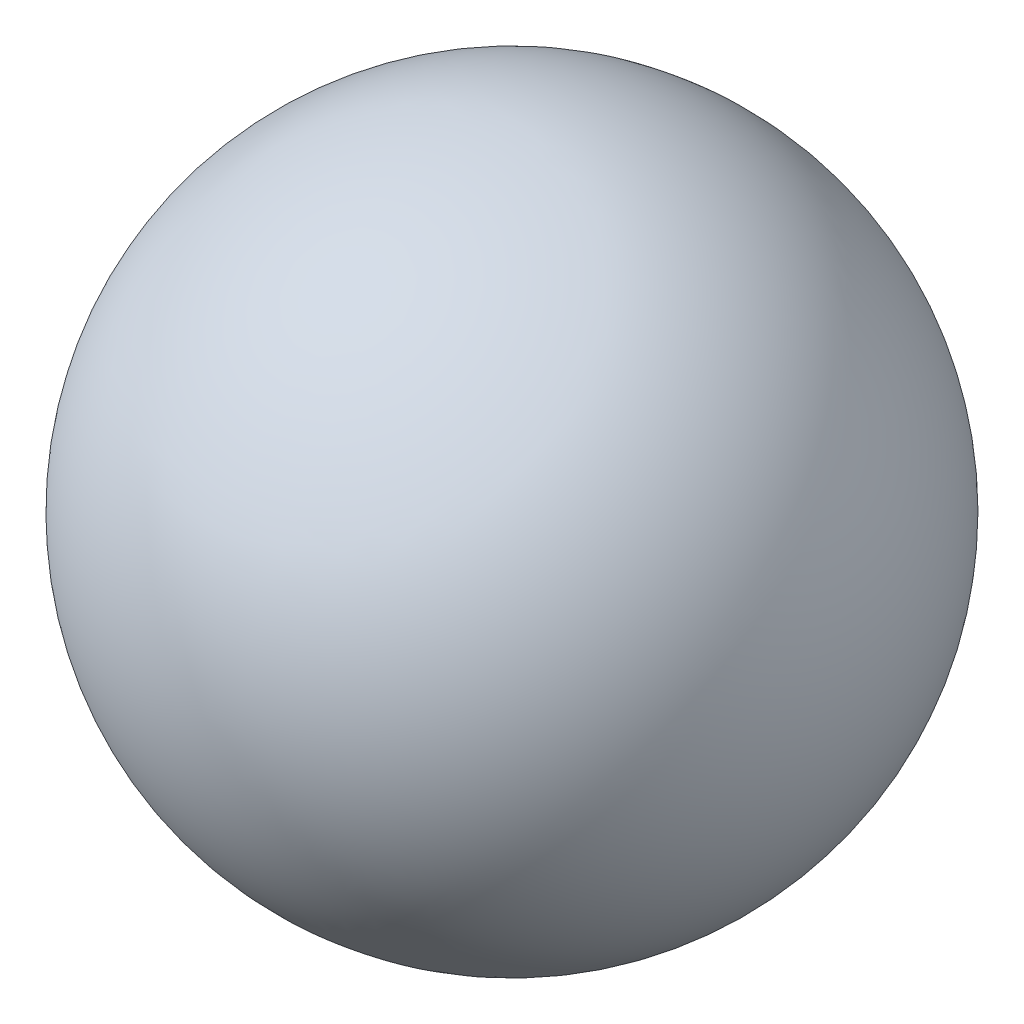
ISO-10303-21;
HEADER;
FILE_DESCRIPTION(('STEP AP214'),'2;1');
FILE_NAME('part.step','',(''),(''),'','','');
FILE_SCHEMA(('AUTOMOTIVE_DESIGN { 1 0 10303 214 1 1 1 1 }'));
ENDSEC;
DATA;
#1=APPLICATION_CONTEXT('core data for automotive mechanical design processes');
#2=APPLICATION_PROTOCOL_DEFINITION('international standard','automotive_design',2000,#1);
#3=PRODUCT_CONTEXT('',#1,'mechanical');
#4=PRODUCT('Part','Part','',(#3));
#5=PRODUCT_RELATED_PRODUCT_CATEGORY('part','',(#4));
#6=PRODUCT_DEFINITION_FORMATION('','',#4);
#7=PRODUCT_DEFINITION_CONTEXT('part definition',#1,'design');
#8=PRODUCT_DEFINITION('design','',#6,#7);
#9=PRODUCT_DEFINITION_SHAPE('','',#8);
#10=(LENGTH_UNIT() NAMED_UNIT(*) SI_UNIT(.MILLI.,.METRE.));
#11=(NAMED_UNIT(*) PLANE_ANGLE_UNIT() SI_UNIT($,.RADIAN.));
#12=(NAMED_UNIT(*) SI_UNIT($,.STERADIAN.) SOLID_ANGLE_UNIT());
#13=UNCERTAINTY_MEASURE_WITH_UNIT(LENGTH_MEASURE(1.E-05),#10,'distance_accuracy_value','');
#14=(GEOMETRIC_REPRESENTATION_CONTEXT(3) GLOBAL_UNCERTAINTY_ASSIGNED_CONTEXT((#13)) GLOBAL_UNIT_ASSIGNED_CONTEXT((#10,
#11,#12)) REPRESENTATION_CONTEXT('',''));
#15=CARTESIAN_POINT('',(0.,0.,0.));
#16=DIRECTION('',(0.,0.,1.));
#17=DIRECTION('',(1.,0.,0.));
#18=AXIS2_PLACEMENT_3D('',#15,#16,#17);
#19=CARTESIAN_POINT('',(49.75,47.2684618367801,-23.9716398236513));
#20=DIRECTION('',(0.,0.891866184337212,-0.452299357987365));
#21=DIRECTION('',(0.173648177666933,0.445427914428401,0.878316732984701));
#22=AXIS2_PLACEMENT_3D('',#19,#20,#21);
#23=SPHERICAL_SURFACE('',#22,5.95);
#24=CARTESIAN_POINT('',(49.75,41.9618580399737,-21.2804586436265));
#25=VERTEX_POINT('',#24);
#26=VERTEX_LOOP('',#25);
#27=FACE_BOUND('',#26,.T.);
#28=CARTESIAN_POINT('',(49.75,52.5750656335865,-26.6628210036761));
#29=VERTEX_POINT('',#28);
#30=VERTEX_LOOP('',#29);
#31=FACE_BOUND('',#30,.T.);
#32=ADVANCED_FACE('F16',(#27,#31),#23,.T.);
#33=CLOSED_SHELL('',(#32));
#34=MANIFOLD_SOLID_BREP('B1',#33);
#35=ADVANCED_BREP_SHAPE_REPRESENTATION('',(#18,#34),#14);
#36=SHAPE_DEFINITION_REPRESENTATION(#9,#35);
ENDSEC;
END-ISO-10303-21;
